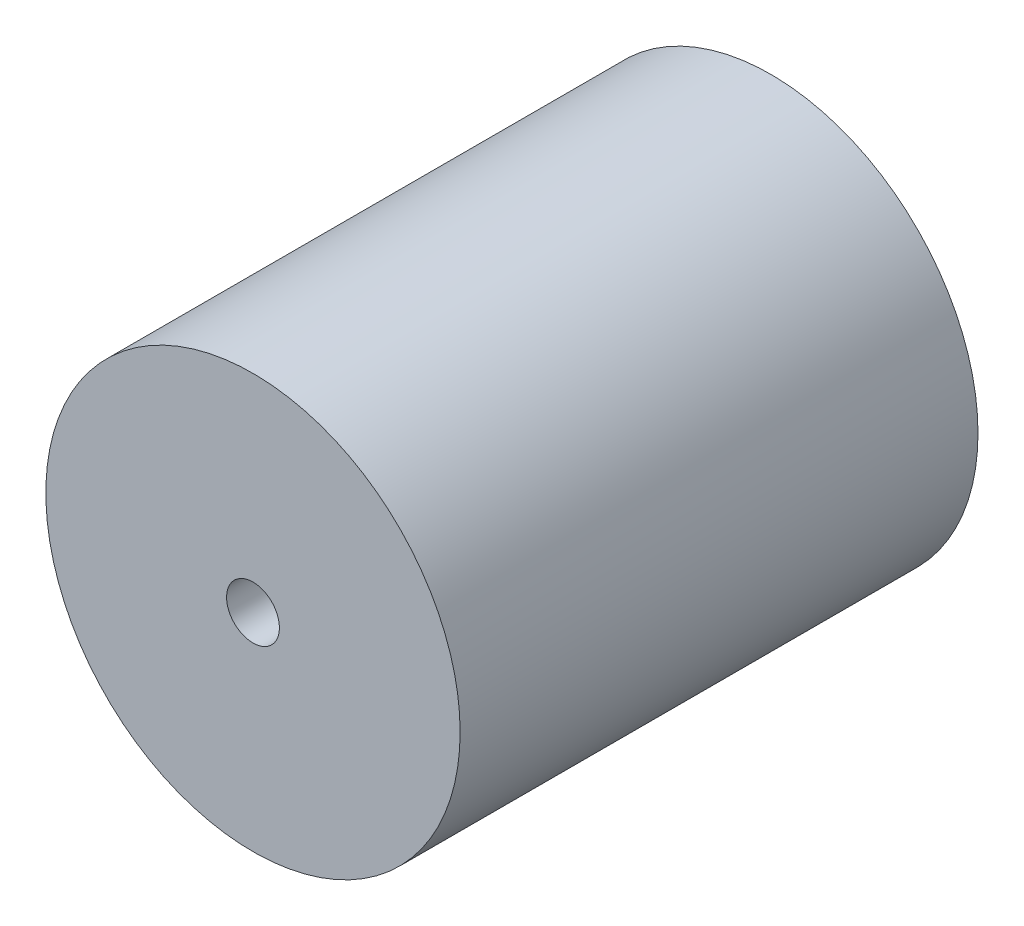
ISO-10303-21;
HEADER;
FILE_DESCRIPTION(('STEP AP214'),'2;1');
FILE_NAME('part.step','',(''),(''),'','','');
FILE_SCHEMA(('AUTOMOTIVE_DESIGN { 1 0 10303 214 1 1 1 1 }'));
ENDSEC;
DATA;
#1=APPLICATION_CONTEXT('core data for automotive mechanical design processes');
#2=APPLICATION_PROTOCOL_DEFINITION('international standard','automotive_design',2000,#1);
#3=PRODUCT_CONTEXT('',#1,'mechanical');
#4=PRODUCT('Part','Part','',(#3));
#5=PRODUCT_RELATED_PRODUCT_CATEGORY('part','',(#4));
#6=PRODUCT_DEFINITION_FORMATION('','',#4);
#7=PRODUCT_DEFINITION_CONTEXT('part definition',#1,'design');
#8=PRODUCT_DEFINITION('design','',#6,#7);
#9=PRODUCT_DEFINITION_SHAPE('','',#8);
#10=(LENGTH_UNIT() NAMED_UNIT(*) SI_UNIT(.MILLI.,.METRE.));
#11=(NAMED_UNIT(*) PLANE_ANGLE_UNIT() SI_UNIT($,.RADIAN.));
#12=(NAMED_UNIT(*) SI_UNIT($,.STERADIAN.) SOLID_ANGLE_UNIT());
#13=UNCERTAINTY_MEASURE_WITH_UNIT(LENGTH_MEASURE(1.E-05),#10,'distance_accuracy_value','');
#14=(GEOMETRIC_REPRESENTATION_CONTEXT(3) GLOBAL_UNCERTAINTY_ASSIGNED_CONTEXT((#13)) GLOBAL_UNIT_ASSIGNED_CONTEXT((#10,
#11,#12)) REPRESENTATION_CONTEXT('',''));
#15=CARTESIAN_POINT('',(0.,0.,0.));
#16=DIRECTION('',(0.,0.,1.));
#17=DIRECTION('',(1.,0.,0.));
#18=AXIS2_PLACEMENT_3D('',#15,#16,#17);
#19=CARTESIAN_POINT('',(0.,0.,100.));
#20=DIRECTION('',(0.,0.,-1.));
#21=DIRECTION('',(-1.,0.,0.));
#22=AXIS2_PLACEMENT_3D('',#19,#20,#21);
#23=CYLINDRICAL_SURFACE('',#22,40.);
#24=CARTESIAN_POINT('',(0.,0.,100.));
#25=DIRECTION('',(0.,0.,1.));
#26=DIRECTION('',(1.,0.,0.));
#27=AXIS2_PLACEMENT_3D('',#24,#25,#26);
#28=CIRCLE('',#27,40.);
#29=CARTESIAN_POINT('',(40.,0.,100.));
#30=VERTEX_POINT('',#29);
#31=EDGE_CURVE('E10',#30,#30,#28,.T.);
#32=ORIENTED_EDGE('',*,*,#31,.F.);
#33=EDGE_LOOP('',(#32));
#34=FACE_BOUND('',#33,.T.);
#35=CARTESIAN_POINT('',(0.,0.,0.));
#36=DIRECTION('',(0.,0.,1.));
#37=DIRECTION('',(1.,0.,0.));
#38=AXIS2_PLACEMENT_3D('',#35,#36,#37);
#39=CIRCLE('',#38,40.);
#40=CARTESIAN_POINT('',(40.,0.,0.));
#41=VERTEX_POINT('',#40);
#42=EDGE_CURVE('E36',#41,#41,#39,.T.);
#43=ORIENTED_EDGE('',*,*,#42,.T.);
#44=EDGE_LOOP('',(#43));
#45=FACE_BOUND('',#44,.T.);
#46=ADVANCED_FACE('F33',(#34,#45),#23,.T.);
#47=CARTESIAN_POINT('',(0.,0.,100.));
#48=DIRECTION('',(0.,0.,1.));
#49=DIRECTION('',(1.,0.,0.));
#50=AXIS2_PLACEMENT_3D('',#47,#48,#49);
#51=PLANE('',#50);
#52=CARTESIAN_POINT('',(0.,0.,100.));
#53=DIRECTION('',(0.,0.,1.));
#54=DIRECTION('',(1.,0.,0.));
#55=AXIS2_PLACEMENT_3D('',#52,#53,#54);
#56=CIRCLE('',#55,5.1);
#57=CARTESIAN_POINT('',(5.1,0.,100.));
#58=VERTEX_POINT('',#57);
#59=EDGE_CURVE('E45',#58,#58,#56,.T.);
#60=ORIENTED_EDGE('',*,*,#59,.F.);
#61=EDGE_LOOP('',(#60));
#62=FACE_BOUND('',#61,.T.);
#63=ORIENTED_EDGE('',*,*,#31,.T.);
#64=EDGE_LOOP('',(#63));
#65=FACE_BOUND('',#64,.T.);
#66=ADVANCED_FACE('F60',(#62,#65),#51,.T.);
#67=CARTESIAN_POINT('',(0.,0.,0.));
#68=DIRECTION('',(0.,0.,1.));
#69=DIRECTION('',(1.,0.,0.));
#70=AXIS2_PLACEMENT_3D('',#67,#68,#69);
#71=PLANE('',#70);
#72=ORIENTED_EDGE('',*,*,#42,.F.);
#73=EDGE_LOOP('',(#72));
#74=FACE_BOUND('',#73,.T.);
#75=ADVANCED_FACE('F56',(#74),#71,.F.);
#76=CARTESIAN_POINT('',(0.,0.,75.));
#77=DIRECTION('',(0.,0.,1.));
#78=DIRECTION('',(1.,0.,0.));
#79=AXIS2_PLACEMENT_3D('',#76,#77,#78);
#80=CYLINDRICAL_SURFACE('',#79,5.1);
#81=CARTESIAN_POINT('',(0.,0.,75.));
#82=DIRECTION('',(0.,0.,1.));
#83=DIRECTION('',(1.,0.,0.));
#84=AXIS2_PLACEMENT_3D('',#81,#82,#83);
#85=CIRCLE('',#84,5.1);
#86=CARTESIAN_POINT('',(5.1,0.,75.));
#87=VERTEX_POINT('',#86);
#88=EDGE_CURVE('E43',#87,#87,#85,.T.);
#89=ORIENTED_EDGE('',*,*,#88,.F.);
#90=EDGE_LOOP('',(#89));
#91=FACE_BOUND('',#90,.T.);
#92=ORIENTED_EDGE('',*,*,#59,.T.);
#93=EDGE_LOOP('',(#92));
#94=FACE_BOUND('',#93,.T.);
#95=ADVANCED_FACE('F53',(#91,#94),#80,.F.);
#96=CARTESIAN_POINT('',(0.,0.,75.));
#97=DIRECTION('',(0.,0.,1.));
#98=DIRECTION('',(1.,0.,0.));
#99=AXIS2_PLACEMENT_3D('',#96,#97,#98);
#100=PLANE('',#99);
#101=ORIENTED_EDGE('',*,*,#88,.T.);
#102=EDGE_LOOP('',(#101));
#103=FACE_BOUND('',#102,.T.);
#104=ADVANCED_FACE('F51',(#103),#100,.T.);
#105=CLOSED_SHELL('',(#46,#66,#75,#95,#104));
#106=MANIFOLD_SOLID_BREP('B2',#105);
#107=ADVANCED_BREP_SHAPE_REPRESENTATION('',(#18,#106),#14);
#108=SHAPE_DEFINITION_REPRESENTATION(#9,#107);
ENDSEC;
END-ISO-10303-21;
